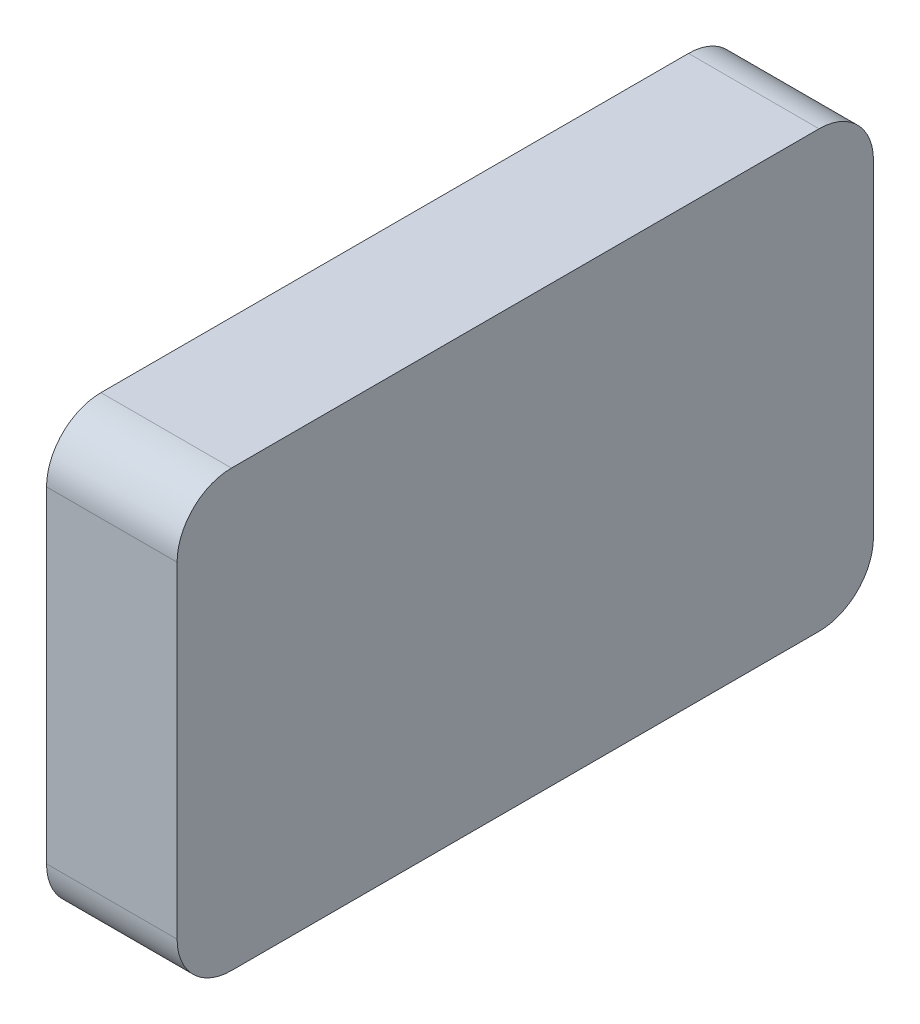
ISO-10303-21;
HEADER;
FILE_DESCRIPTION(('STEP AP214'),'2;1');
FILE_NAME('part.step','',(''),(''),'','','');
FILE_SCHEMA(('AUTOMOTIVE_DESIGN { 1 0 10303 214 1 1 1 1 }'));
ENDSEC;
DATA;
#1=APPLICATION_CONTEXT('core data for automotive mechanical design processes');
#2=APPLICATION_PROTOCOL_DEFINITION('international standard','automotive_design',2000,#1);
#3=PRODUCT_CONTEXT('',#1,'mechanical');
#4=PRODUCT('Part','Part','',(#3));
#5=PRODUCT_RELATED_PRODUCT_CATEGORY('part','',(#4));
#6=PRODUCT_DEFINITION_FORMATION('','',#4);
#7=PRODUCT_DEFINITION_CONTEXT('part definition',#1,'design');
#8=PRODUCT_DEFINITION('design','',#6,#7);
#9=PRODUCT_DEFINITION_SHAPE('','',#8);
#10=(LENGTH_UNIT() NAMED_UNIT(*) SI_UNIT(.MILLI.,.METRE.));
#11=(NAMED_UNIT(*) PLANE_ANGLE_UNIT() SI_UNIT($,.RADIAN.));
#12=(NAMED_UNIT(*) SI_UNIT($,.STERADIAN.) SOLID_ANGLE_UNIT());
#13=UNCERTAINTY_MEASURE_WITH_UNIT(LENGTH_MEASURE(1.E-05),#10,'distance_accuracy_value','');
#14=(GEOMETRIC_REPRESENTATION_CONTEXT(3) GLOBAL_UNCERTAINTY_ASSIGNED_CONTEXT((#13)) GLOBAL_UNIT_ASSIGNED_CONTEXT((#10,
#11,#12)) REPRESENTATION_CONTEXT('',''));
#15=CARTESIAN_POINT('',(0.,0.,0.));
#16=DIRECTION('',(0.,0.,1.));
#17=DIRECTION('',(1.,0.,0.));
#18=AXIS2_PLACEMENT_3D('',#15,#16,#17);
#19=CARTESIAN_POINT('',(12.,15.,-27.));
#20=DIRECTION('',(-1.,0.,0.));
#21=DIRECTION('',(0.,0.,1.));
#22=AXIS2_PLACEMENT_3D('',#19,#20,#21);
#23=CYLINDRICAL_SURFACE('',#22,5.00000000000001);
#24=CARTESIAN_POINT('',(0.,15.,-27.));
#25=DIRECTION('',(1.,0.,0.));
#26=DIRECTION('',(0.,0.,1.));
#27=AXIS2_PLACEMENT_3D('',#24,#25,#26);
#28=CIRCLE('',#27,5.00000000000001);
#29=CARTESIAN_POINT('',(0.,15.,-32.));
#30=VERTEX_POINT('',#29);
#31=CARTESIAN_POINT('',(0.,20.,-27.));
#32=VERTEX_POINT('',#31);
#33=EDGE_CURVE('E132',#30,#32,#28,.T.);
#34=ORIENTED_EDGE('',*,*,#33,.T.);
#35=DIRECTION('',(-1.,0.,0.));
#36=VECTOR('',#35,1.);
#37=CARTESIAN_POINT('',(12.,20.,-27.));
#38=LINE('',#37,#36);
#39=CARTESIAN_POINT('',(12.,20.,-27.));
#40=VERTEX_POINT('',#39);
#41=EDGE_CURVE('E11',#40,#32,#38,.T.);
#42=ORIENTED_EDGE('',*,*,#41,.F.);
#43=CARTESIAN_POINT('',(12.,15.,-27.));
#44=DIRECTION('',(1.,0.,0.));
#45=DIRECTION('',(0.,0.,1.));
#46=AXIS2_PLACEMENT_3D('',#43,#44,#45);
#47=CIRCLE('',#46,5.00000000000001);
#48=CARTESIAN_POINT('',(12.,15.,-32.));
#49=VERTEX_POINT('',#48);
#50=EDGE_CURVE('E147',#49,#40,#47,.T.);
#51=ORIENTED_EDGE('',*,*,#50,.F.);
#52=DIRECTION('',(-1.,0.,0.));
#53=VECTOR('',#52,1.);
#54=CARTESIAN_POINT('',(12.,15.,-32.));
#55=LINE('',#54,#53);
#56=EDGE_CURVE('E128',#49,#30,#55,.T.);
#57=ORIENTED_EDGE('',*,*,#56,.T.);
#58=EDGE_LOOP('',(#34,#42,#51,#57));
#59=FACE_BOUND('',#58,.T.);
#60=ADVANCED_FACE('F36',(#59),#23,.T.);
#61=CARTESIAN_POINT('',(12.,20.,27.));
#62=DIRECTION('',(0.,-1.,0.));
#63=DIRECTION('',(0.,0.,-1.));
#64=AXIS2_PLACEMENT_3D('',#61,#62,#63);
#65=PLANE('',#64);
#66=DIRECTION('',(0.,0.,1.));
#67=VECTOR('',#66,1.);
#68=CARTESIAN_POINT('',(0.,20.,27.));
#69=LINE('',#68,#67);
#70=CARTESIAN_POINT('',(0.,20.,27.));
#71=VERTEX_POINT('',#70);
#72=EDGE_CURVE('E135',#32,#71,#69,.T.);
#73=ORIENTED_EDGE('',*,*,#72,.T.);
#74=DIRECTION('',(-1.,0.,0.));
#75=VECTOR('',#74,1.);
#76=CARTESIAN_POINT('',(12.,20.,27.));
#77=LINE('',#76,#75);
#78=CARTESIAN_POINT('',(12.,20.,27.));
#79=VERTEX_POINT('',#78);
#80=EDGE_CURVE('E44',#79,#71,#77,.T.);
#81=ORIENTED_EDGE('',*,*,#80,.F.);
#82=DIRECTION('',(0.,0.,1.));
#83=VECTOR('',#82,1.);
#84=CARTESIAN_POINT('',(12.,20.,27.));
#85=LINE('',#84,#83);
#86=EDGE_CURVE('E95',#40,#79,#85,.T.);
#87=ORIENTED_EDGE('',*,*,#86,.F.);
#88=ORIENTED_EDGE('',*,*,#41,.T.);
#89=EDGE_LOOP('',(#73,#81,#87,#88));
#90=FACE_BOUND('',#89,.T.);
#91=ADVANCED_FACE('F211',(#90),#65,.F.);
#92=CARTESIAN_POINT('',(12.,15.,27.));
#93=DIRECTION('',(-1.,0.,0.));
#94=DIRECTION('',(0.,0.,1.));
#95=AXIS2_PLACEMENT_3D('',#92,#93,#94);
#96=CYLINDRICAL_SURFACE('',#95,5.);
#97=CARTESIAN_POINT('',(0.,15.,27.));
#98=DIRECTION('',(1.,0.,0.));
#99=DIRECTION('',(0.,0.,1.));
#100=AXIS2_PLACEMENT_3D('',#97,#98,#99);
#101=CIRCLE('',#100,5.);
#102=CARTESIAN_POINT('',(0.,15.,32.));
#103=VERTEX_POINT('',#102);
#104=EDGE_CURVE('E138',#71,#103,#101,.T.);
#105=ORIENTED_EDGE('',*,*,#104,.T.);
#106=DIRECTION('',(-1.,0.,0.));
#107=VECTOR('',#106,1.);
#108=CARTESIAN_POINT('',(12.,15.,32.));
#109=LINE('',#108,#107);
#110=CARTESIAN_POINT('',(12.,15.,32.));
#111=VERTEX_POINT('',#110);
#112=EDGE_CURVE('E154',#111,#103,#109,.T.);
#113=ORIENTED_EDGE('',*,*,#112,.F.);
#114=CARTESIAN_POINT('',(12.,15.,27.));
#115=DIRECTION('',(1.,0.,0.));
#116=DIRECTION('',(0.,0.,1.));
#117=AXIS2_PLACEMENT_3D('',#114,#115,#116);
#118=CIRCLE('',#117,5.);
#119=EDGE_CURVE('E162',#79,#111,#118,.T.);
#120=ORIENTED_EDGE('',*,*,#119,.F.);
#121=ORIENTED_EDGE('',*,*,#80,.T.);
#122=EDGE_LOOP('',(#105,#113,#120,#121));
#123=FACE_BOUND('',#122,.T.);
#124=ADVANCED_FACE('F160',(#123),#96,.T.);
#125=CARTESIAN_POINT('',(12.,15.,32.));
#126=DIRECTION('',(0.,0.,-1.));
#127=DIRECTION('',(-1.,0.,0.));
#128=AXIS2_PLACEMENT_3D('',#125,#126,#127);
#129=PLANE('',#128);
#130=DIRECTION('',(0.,-1.,0.));
#131=VECTOR('',#130,1.);
#132=CARTESIAN_POINT('',(0.,15.,32.));
#133=LINE('',#132,#131);
#134=CARTESIAN_POINT('',(0.,-15.,32.));
#135=VERTEX_POINT('',#134);
#136=EDGE_CURVE('E140',#103,#135,#133,.T.);
#137=ORIENTED_EDGE('',*,*,#136,.T.);
#138=DIRECTION('',(-1.,0.,0.));
#139=VECTOR('',#138,1.);
#140=CARTESIAN_POINT('',(12.,-15.,32.));
#141=LINE('',#140,#139);
#142=CARTESIAN_POINT('',(12.,-15.,32.));
#143=VERTEX_POINT('',#142);
#144=EDGE_CURVE('E151',#143,#135,#141,.T.);
#145=ORIENTED_EDGE('',*,*,#144,.F.);
#146=DIRECTION('',(0.,-1.,0.));
#147=VECTOR('',#146,1.);
#148=CARTESIAN_POINT('',(12.,15.,32.));
#149=LINE('',#148,#147);
#150=EDGE_CURVE('E174',#111,#143,#149,.T.);
#151=ORIENTED_EDGE('',*,*,#150,.F.);
#152=ORIENTED_EDGE('',*,*,#112,.T.);
#153=EDGE_LOOP('',(#137,#145,#151,#152));
#154=FACE_BOUND('',#153,.T.);
#155=ADVANCED_FACE('F170',(#154),#129,.F.);
#156=CARTESIAN_POINT('',(12.,-15.,27.));
#157=DIRECTION('',(-1.,0.,0.));
#158=DIRECTION('',(0.,0.,1.));
#159=AXIS2_PLACEMENT_3D('',#156,#157,#158);
#160=CYLINDRICAL_SURFACE('',#159,5.);
#161=CARTESIAN_POINT('',(0.,-15.,27.));
#162=DIRECTION('',(1.,0.,0.));
#163=DIRECTION('',(0.,0.,1.));
#164=AXIS2_PLACEMENT_3D('',#161,#162,#163);
#165=CIRCLE('',#164,5.);
#166=CARTESIAN_POINT('',(0.,-20.,27.));
#167=VERTEX_POINT('',#166);
#168=EDGE_CURVE('E142',#135,#167,#165,.T.);
#169=ORIENTED_EDGE('',*,*,#168,.T.);
#170=DIRECTION('',(-1.,0.,0.));
#171=VECTOR('',#170,1.);
#172=CARTESIAN_POINT('',(12.,-20.,27.));
#173=LINE('',#172,#171);
#174=CARTESIAN_POINT('',(12.,-20.,27.));
#175=VERTEX_POINT('',#174);
#176=EDGE_CURVE('E123',#175,#167,#173,.T.);
#177=ORIENTED_EDGE('',*,*,#176,.F.);
#178=CARTESIAN_POINT('',(12.,-15.,27.));
#179=DIRECTION('',(1.,0.,0.));
#180=DIRECTION('',(0.,0.,1.));
#181=AXIS2_PLACEMENT_3D('',#178,#179,#180);
#182=CIRCLE('',#181,5.);
#183=EDGE_CURVE('E114',#143,#175,#182,.T.);
#184=ORIENTED_EDGE('',*,*,#183,.F.);
#185=ORIENTED_EDGE('',*,*,#144,.T.);
#186=EDGE_LOOP('',(#169,#177,#184,#185));
#187=FACE_BOUND('',#186,.T.);
#188=ADVANCED_FACE('F173',(#187),#160,.T.);
#189=CARTESIAN_POINT('',(12.,-20.,27.));
#190=DIRECTION('',(0.,1.,0.));
#191=DIRECTION('',(0.,0.,1.));
#192=AXIS2_PLACEMENT_3D('',#189,#190,#191);
#193=PLANE('',#192);
#194=CARTESIAN_POINT('',(4.,-20.,0.));
#195=DIRECTION('',(0.,-1.,0.));
#196=DIRECTION('',(0.,0.,-1.));
#197=AXIS2_PLACEMENT_3D('',#194,#195,#196);
#198=CIRCLE('',#197,2.5);
#199=CARTESIAN_POINT('',(4.,-20.,-2.5));
#200=VERTEX_POINT('',#199);
#201=EDGE_CURVE('E186',#200,#200,#198,.T.);
#202=ORIENTED_EDGE('',*,*,#201,.F.);
#203=EDGE_LOOP('',(#202));
#204=FACE_BOUND('',#203,.T.);
#205=DIRECTION('',(0.,0.,-1.));
#206=VECTOR('',#205,1.);
#207=CARTESIAN_POINT('',(0.,-20.,27.));
#208=LINE('',#207,#206);
#209=CARTESIAN_POINT('',(0.,-20.,-27.));
#210=VERTEX_POINT('',#209);
#211=EDGE_CURVE('E122',#167,#210,#208,.T.);
#212=ORIENTED_EDGE('',*,*,#211,.T.);
#213=DIRECTION('',(-1.,0.,0.));
#214=VECTOR('',#213,1.);
#215=CARTESIAN_POINT('',(12.,-20.,-27.));
#216=LINE('',#215,#214);
#217=CARTESIAN_POINT('',(12.,-20.,-27.));
#218=VERTEX_POINT('',#217);
#219=EDGE_CURVE('E119',#218,#210,#216,.T.);
#220=ORIENTED_EDGE('',*,*,#219,.F.);
#221=DIRECTION('',(0.,0.,-1.));
#222=VECTOR('',#221,1.);
#223=CARTESIAN_POINT('',(12.,-20.,27.));
#224=LINE('',#223,#222);
#225=EDGE_CURVE('E108',#175,#218,#224,.T.);
#226=ORIENTED_EDGE('',*,*,#225,.F.);
#227=ORIENTED_EDGE('',*,*,#176,.T.);
#228=EDGE_LOOP('',(#212,#220,#226,#227));
#229=FACE_BOUND('',#228,.T.);
#230=ADVANCED_FACE('F120',(#204,#229),#193,.F.);
#231=CARTESIAN_POINT('',(12.,-15.,-27.));
#232=DIRECTION('',(-1.,0.,0.));
#233=DIRECTION('',(0.,0.,1.));
#234=AXIS2_PLACEMENT_3D('',#231,#232,#233);
#235=CYLINDRICAL_SURFACE('',#234,5.00000000000001);
#236=CARTESIAN_POINT('',(0.,-15.,-27.));
#237=DIRECTION('',(1.,0.,0.));
#238=DIRECTION('',(0.,0.,-1.));
#239=AXIS2_PLACEMENT_3D('',#236,#237,#238);
#240=CIRCLE('',#239,5.00000000000001);
#241=CARTESIAN_POINT('',(0.,-15.,-32.));
#242=VERTEX_POINT('',#241);
#243=EDGE_CURVE('E81',#210,#242,#240,.T.);
#244=ORIENTED_EDGE('',*,*,#243,.T.);
#245=DIRECTION('',(-1.,0.,0.));
#246=VECTOR('',#245,1.);
#247=CARTESIAN_POINT('',(12.,-15.,-32.));
#248=LINE('',#247,#246);
#249=CARTESIAN_POINT('',(12.,-15.,-32.));
#250=VERTEX_POINT('',#249);
#251=EDGE_CURVE('E124',#250,#242,#248,.T.);
#252=ORIENTED_EDGE('',*,*,#251,.F.);
#253=CARTESIAN_POINT('',(12.,-15.,-27.));
#254=DIRECTION('',(1.,0.,0.));
#255=DIRECTION('',(0.,0.,-1.));
#256=AXIS2_PLACEMENT_3D('',#253,#254,#255);
#257=CIRCLE('',#256,5.00000000000001);
#258=EDGE_CURVE('E112',#218,#250,#257,.T.);
#259=ORIENTED_EDGE('',*,*,#258,.F.);
#260=ORIENTED_EDGE('',*,*,#219,.T.);
#261=EDGE_LOOP('',(#244,#252,#259,#260));
#262=FACE_BOUND('',#261,.T.);
#263=ADVANCED_FACE('F126',(#262),#235,.T.);
#264=CARTESIAN_POINT('',(12.,15.,-32.));
#265=DIRECTION('',(0.,0.,1.));
#266=DIRECTION('',(0.,-1.,0.));
#267=AXIS2_PLACEMENT_3D('',#264,#265,#266);
#268=PLANE('',#267);
#269=DIRECTION('',(0.,1.,0.));
#270=VECTOR('',#269,1.);
#271=CARTESIAN_POINT('',(0.,15.,-32.));
#272=LINE('',#271,#270);
#273=EDGE_CURVE('E87',#242,#30,#272,.T.);
#274=ORIENTED_EDGE('',*,*,#273,.T.);
#275=ORIENTED_EDGE('',*,*,#56,.F.);
#276=DIRECTION('',(0.,1.,0.));
#277=VECTOR('',#276,1.);
#278=CARTESIAN_POINT('',(12.,15.,-32.));
#279=LINE('',#278,#277);
#280=EDGE_CURVE('E52',#250,#49,#279,.T.);
#281=ORIENTED_EDGE('',*,*,#280,.F.);
#282=ORIENTED_EDGE('',*,*,#251,.T.);
#283=EDGE_LOOP('',(#274,#275,#281,#282));
#284=FACE_BOUND('',#283,.T.);
#285=ADVANCED_FACE('F207',(#284),#268,.F.);
#286=CARTESIAN_POINT('',(12.,15.,-27.));
#287=DIRECTION('',(-1.,0.,0.));
#288=DIRECTION('',(0.,0.,1.));
#289=AXIS2_PLACEMENT_3D('',#286,#287,#288);
#290=PLANE('',#289);
#291=ORIENTED_EDGE('',*,*,#50,.T.);
#292=ORIENTED_EDGE('',*,*,#86,.T.);
#293=ORIENTED_EDGE('',*,*,#119,.T.);
#294=ORIENTED_EDGE('',*,*,#150,.T.);
#295=ORIENTED_EDGE('',*,*,#183,.T.);
#296=ORIENTED_EDGE('',*,*,#225,.T.);
#297=ORIENTED_EDGE('',*,*,#258,.T.);
#298=ORIENTED_EDGE('',*,*,#280,.T.);
#299=EDGE_LOOP('',(#291,#292,#293,#294,#295,#296,#297,#298));
#300=FACE_BOUND('',#299,.T.);
#301=ADVANCED_FACE('F110',(#300),#290,.F.);
#302=CARTESIAN_POINT('',(0.,15.,-27.));
#303=DIRECTION('',(-1.,0.,0.));
#304=DIRECTION('',(0.,0.,1.));
#305=AXIS2_PLACEMENT_3D('',#302,#303,#304);
#306=PLANE('',#305);
#307=CARTESIAN_POINT('',(0.,0.,0.));
#308=DIRECTION('',(-1.,0.,0.));
#309=DIRECTION('',(0.,0.,1.));
#310=AXIS2_PLACEMENT_3D('',#307,#308,#309);
#311=CIRCLE('',#310,8.);
#312=CARTESIAN_POINT('',(0.,0.,8.));
#313=VERTEX_POINT('',#312);
#314=EDGE_CURVE('E180',#313,#313,#311,.T.);
#315=ORIENTED_EDGE('',*,*,#314,.F.);
#316=EDGE_LOOP('',(#315));
#317=FACE_BOUND('',#316,.T.);
#318=ORIENTED_EDGE('',*,*,#33,.F.);
#319=ORIENTED_EDGE('',*,*,#273,.F.);
#320=ORIENTED_EDGE('',*,*,#243,.F.);
#321=ORIENTED_EDGE('',*,*,#211,.F.);
#322=ORIENTED_EDGE('',*,*,#168,.F.);
#323=ORIENTED_EDGE('',*,*,#136,.F.);
#324=ORIENTED_EDGE('',*,*,#104,.F.);
#325=ORIENTED_EDGE('',*,*,#72,.F.);
#326=EDGE_LOOP('',(#318,#319,#320,#321,#322,#323,#324,#325));
#327=FACE_BOUND('',#326,.T.);
#328=ADVANCED_FACE('F166',(#317,#327),#306,.T.);
#329=CARTESIAN_POINT('',(8.,0.,0.));
#330=DIRECTION('',(-1.,0.,0.));
#331=DIRECTION('',(0.,0.,1.));
#332=AXIS2_PLACEMENT_3D('',#329,#330,#331);
#333=CYLINDRICAL_SURFACE('',#332,8.);
#334=CARTESIAN_POINT('',(8.,0.,0.));
#335=DIRECTION('',(-1.,0.,0.));
#336=DIRECTION('',(0.,0.,1.));
#337=AXIS2_PLACEMENT_3D('',#334,#335,#336);
#338=CIRCLE('',#337,8.);
#339=CARTESIAN_POINT('',(8.,0.,8.));
#340=VERTEX_POINT('',#339);
#341=EDGE_CURVE('E136',#340,#340,#338,.T.);
#342=ORIENTED_EDGE('',*,*,#341,.F.);
#343=EDGE_LOOP('',(#342));
#344=FACE_BOUND('',#343,.T.);
#345=ORIENTED_EDGE('',*,*,#314,.T.);
#346=EDGE_LOOP('',(#345));
#347=FACE_BOUND('',#346,.T.);
#348=ADVANCED_FACE('F226',(#344,#347),#333,.F.);
#349=CARTESIAN_POINT('',(8.,0.,0.));
#350=DIRECTION('',(-1.,0.,0.));
#351=DIRECTION('',(0.,0.,1.));
#352=AXIS2_PLACEMENT_3D('',#349,#350,#351);
#353=PLANE('',#352);
#354=ORIENTED_EDGE('',*,*,#341,.T.);
#355=EDGE_LOOP('',(#354));
#356=FACE_BOUND('',#355,.T.);
#357=ADVANCED_FACE('F197',(#356),#353,.T.);
#358=CARTESIAN_POINT('',(4.,-10.,0.));
#359=DIRECTION('',(0.,-1.,0.));
#360=DIRECTION('',(0.,0.,-1.));
#361=AXIS2_PLACEMENT_3D('',#358,#359,#360);
#362=CYLINDRICAL_SURFACE('',#361,2.5);
#363=CARTESIAN_POINT('',(4.,-10.,0.));
#364=DIRECTION('',(0.,-1.,0.));
#365=DIRECTION('',(0.,0.,-1.));
#366=AXIS2_PLACEMENT_3D('',#363,#364,#365);
#367=CIRCLE('',#366,2.5);
#368=CARTESIAN_POINT('',(4.,-10.,-2.5));
#369=VERTEX_POINT('',#368);
#370=EDGE_CURVE('E183',#369,#369,#367,.T.);
#371=ORIENTED_EDGE('',*,*,#370,.F.);
#372=EDGE_LOOP('',(#371));
#373=FACE_BOUND('',#372,.T.);
#374=ORIENTED_EDGE('',*,*,#201,.T.);
#375=EDGE_LOOP('',(#374));
#376=FACE_BOUND('',#375,.T.);
#377=ADVANCED_FACE('F194',(#373,#376),#362,.F.);
#378=CARTESIAN_POINT('',(4.,-10.,0.));
#379=DIRECTION('',(0.,-1.,0.));
#380=DIRECTION('',(0.,0.,-1.));
#381=AXIS2_PLACEMENT_3D('',#378,#379,#380);
#382=PLANE('',#381);
#383=ORIENTED_EDGE('',*,*,#370,.T.);
#384=EDGE_LOOP('',(#383));
#385=FACE_BOUND('',#384,.T.);
#386=ADVANCED_FACE('F192',(#385),#382,.T.);
#387=CLOSED_SHELL('',(#60,#91,#124,#155,#188,#230,#263,#285,#301,#328,#348,#357,#377,#386));
#388=MANIFOLD_SOLID_BREP('B2',#387);
#389=ADVANCED_BREP_SHAPE_REPRESENTATION('',(#18,#388),#14);
#390=SHAPE_DEFINITION_REPRESENTATION(#9,#389);
ENDSEC;
END-ISO-10303-21;
